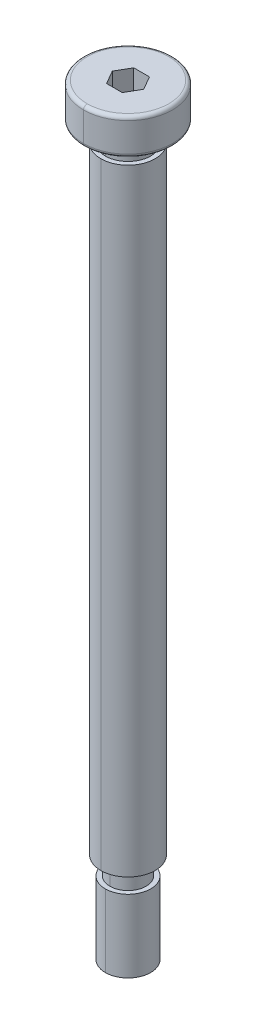
ISO-10303-21;
HEADER;
FILE_DESCRIPTION(('STEP AP214'),'2;1');
FILE_NAME('part.step','',(''),(''),'','','');
FILE_SCHEMA(('AUTOMOTIVE_DESIGN { 1 0 10303 214 1 1 1 1 }'));
ENDSEC;
DATA;
#1=APPLICATION_CONTEXT('core data for automotive mechanical design processes');
#2=APPLICATION_PROTOCOL_DEFINITION('international standard','automotive_design',2000,#1);
#3=PRODUCT_CONTEXT('',#1,'mechanical');
#4=PRODUCT('Part','Part','',(#3));
#5=PRODUCT_RELATED_PRODUCT_CATEGORY('part','',(#4));
#6=PRODUCT_DEFINITION_FORMATION('','',#4);
#7=PRODUCT_DEFINITION_CONTEXT('part definition',#1,'design');
#8=PRODUCT_DEFINITION('design','',#6,#7);
#9=PRODUCT_DEFINITION_SHAPE('','',#8);
#10=(LENGTH_UNIT() NAMED_UNIT(*) SI_UNIT(.MILLI.,.METRE.));
#11=(NAMED_UNIT(*) PLANE_ANGLE_UNIT() SI_UNIT($,.RADIAN.));
#12=(NAMED_UNIT(*) SI_UNIT($,.STERADIAN.) SOLID_ANGLE_UNIT());
#13=UNCERTAINTY_MEASURE_WITH_UNIT(LENGTH_MEASURE(1.E-05),#10,'distance_accuracy_value','');
#14=(GEOMETRIC_REPRESENTATION_CONTEXT(3) GLOBAL_UNCERTAINTY_ASSIGNED_CONTEXT((#13)) GLOBAL_UNIT_ASSIGNED_CONTEXT((#10,
#11,#12)) REPRESENTATION_CONTEXT('',''));
#15=CARTESIAN_POINT('',(0.,0.,0.));
#16=DIRECTION('',(0.,0.,1.));
#17=DIRECTION('',(1.,0.,0.));
#18=AXIS2_PLACEMENT_3D('',#15,#16,#17);
#19=CARTESIAN_POINT('',(0.,80.5,0.));
#20=DIRECTION('',(0.,1.,0.));
#21=DIRECTION('',(1.,0.,0.));
#22=AXIS2_PLACEMENT_3D('',#19,#20,#21);
#23=PLANE('',#22);
#24=DIRECTION('',(-0.5,0.,-0.866025403784439));
#25=VECTOR('',#24,1.);
#26=CARTESIAN_POINT('',(1.73205080756888,80.5,0.));
#27=LINE('',#26,#25);
#28=CARTESIAN_POINT('',(1.73205080756888,80.5,0.));
#29=VERTEX_POINT('',#28);
#30=CARTESIAN_POINT('',(0.866025403784438,80.5,-1.5));
#31=VERTEX_POINT('',#30);
#32=EDGE_CURVE('E191',#29,#31,#27,.T.);
#33=ORIENTED_EDGE('',*,*,#32,.T.);
#34=DIRECTION('',(-1.,0.,0.));
#35=VECTOR('',#34,1.);
#36=CARTESIAN_POINT('',(0.866025403784438,80.5,-1.5));
#37=LINE('',#36,#35);
#38=CARTESIAN_POINT('',(-0.866025403784439,80.5,-1.5));
#39=VERTEX_POINT('',#38);
#40=EDGE_CURVE('E10',#31,#39,#37,.T.);
#41=ORIENTED_EDGE('',*,*,#40,.T.);
#42=DIRECTION('',(-0.5,0.,0.866025403784439));
#43=VECTOR('',#42,1.);
#44=CARTESIAN_POINT('',(-0.866025403784439,80.5,-1.5));
#45=LINE('',#44,#43);
#46=CARTESIAN_POINT('',(-1.73205080756888,80.5,0.));
#47=VERTEX_POINT('',#46);
#48=EDGE_CURVE('E43',#39,#47,#45,.T.);
#49=ORIENTED_EDGE('',*,*,#48,.T.);
#50=DIRECTION('',(0.5,0.,0.866025403784439));
#51=VECTOR('',#50,1.);
#52=CARTESIAN_POINT('',(-1.73205080756888,80.5,0.));
#53=LINE('',#52,#51);
#54=CARTESIAN_POINT('',(-0.866025403784439,80.5,1.5));
#55=VERTEX_POINT('',#54);
#56=EDGE_CURVE('E269',#47,#55,#53,.T.);
#57=ORIENTED_EDGE('',*,*,#56,.T.);
#58=DIRECTION('',(1.,0.,0.));
#59=VECTOR('',#58,1.);
#60=CARTESIAN_POINT('',(-0.866025403784439,80.5,1.5));
#61=LINE('',#60,#59);
#62=CARTESIAN_POINT('',(0.866025403784438,80.5,1.5));
#63=VERTEX_POINT('',#62);
#64=EDGE_CURVE('E263',#55,#63,#61,.T.);
#65=ORIENTED_EDGE('',*,*,#64,.T.);
#66=DIRECTION('',(0.5,0.,-0.866025403784439));
#67=VECTOR('',#66,1.);
#68=CARTESIAN_POINT('',(0.866025403784438,80.5,1.5));
#69=LINE('',#68,#67);
#70=EDGE_CURVE('E257',#63,#29,#69,.T.);
#71=ORIENTED_EDGE('',*,*,#70,.T.);
#72=EDGE_LOOP('',(#33,#41,#49,#57,#65,#71));
#73=FACE_BOUND('',#72,.T.);
#74=ADVANCED_FACE('F16',(#73),#23,.T.);
#75=CARTESIAN_POINT('',(0.866025403784438,80.5,-1.5));
#76=DIRECTION('',(0.,0.,-1.));
#77=DIRECTION('',(-1.,0.,0.));
#78=AXIS2_PLACEMENT_3D('',#75,#76,#77);
#79=PLANE('',#78);
#80=DIRECTION('',(-1.,0.,0.));
#81=VECTOR('',#80,1.);
#82=CARTESIAN_POINT('',(0.866025403784438,84.,-1.5));
#83=LINE('',#82,#81);
#84=CARTESIAN_POINT('',(0.866025403784438,84.,-1.5));
#85=VERTEX_POINT('',#84);
#86=CARTESIAN_POINT('',(-0.866025403784439,84.,-1.5));
#87=VERTEX_POINT('',#86);
#88=EDGE_CURVE('E187',#85,#87,#83,.T.);
#89=ORIENTED_EDGE('',*,*,#88,.T.);
#90=DIRECTION('',(0.,1.,0.));
#91=VECTOR('',#90,1.);
#92=CARTESIAN_POINT('',(-0.866025403784439,80.5,-1.5));
#93=LINE('',#92,#91);
#94=EDGE_CURVE('E24',#39,#87,#93,.T.);
#95=ORIENTED_EDGE('',*,*,#94,.F.);
#96=ORIENTED_EDGE('',*,*,#40,.F.);
#97=DIRECTION('',(0.,1.,0.));
#98=VECTOR('',#97,1.);
#99=CARTESIAN_POINT('',(0.866025403784438,80.5,-1.5));
#100=LINE('',#99,#98);
#101=EDGE_CURVE('E183',#31,#85,#100,.T.);
#102=ORIENTED_EDGE('',*,*,#101,.T.);
#103=EDGE_LOOP('',(#89,#95,#96,#102));
#104=FACE_BOUND('',#103,.T.);
#105=ADVANCED_FACE('F185',(#104),#79,.F.);
#106=CARTESIAN_POINT('',(-0.866025403784439,80.5,-1.5));
#107=DIRECTION('',(-0.866025403784439,0.,-0.5));
#108=DIRECTION('',(-0.5,0.,0.866025403784439));
#109=AXIS2_PLACEMENT_3D('',#106,#107,#108);
#110=PLANE('',#109);
#111=DIRECTION('',(-0.5,0.,0.866025403784439));
#112=VECTOR('',#111,1.);
#113=CARTESIAN_POINT('',(-0.866025403784439,84.,-1.5));
#114=LINE('',#113,#112);
#115=CARTESIAN_POINT('',(-1.73205080756888,84.,0.));
#116=VERTEX_POINT('',#115);
#117=EDGE_CURVE('E210',#87,#116,#114,.T.);
#118=ORIENTED_EDGE('',*,*,#117,.T.);
#119=DIRECTION('',(0.,1.,0.));
#120=VECTOR('',#119,1.);
#121=CARTESIAN_POINT('',(-1.73205080756888,80.5,0.));
#122=LINE('',#121,#120);
#123=EDGE_CURVE('E272',#47,#116,#122,.T.);
#124=ORIENTED_EDGE('',*,*,#123,.F.);
#125=ORIENTED_EDGE('',*,*,#48,.F.);
#126=ORIENTED_EDGE('',*,*,#94,.T.);
#127=EDGE_LOOP('',(#118,#124,#125,#126));
#128=FACE_BOUND('',#127,.T.);
#129=ADVANCED_FACE('F280',(#128),#110,.F.);
#130=CARTESIAN_POINT('',(-1.73205080756888,80.5,0.));
#131=DIRECTION('',(-0.866025403784439,0.,0.5));
#132=DIRECTION('',(0.,1.,0.));
#133=AXIS2_PLACEMENT_3D('',#130,#131,#132);
#134=PLANE('',#133);
#135=DIRECTION('',(0.5,0.,0.866025403784439));
#136=VECTOR('',#135,1.);
#137=CARTESIAN_POINT('',(-1.73205080756888,84.,0.));
#138=LINE('',#137,#136);
#139=CARTESIAN_POINT('',(-0.866025403784439,84.,1.5));
#140=VERTEX_POINT('',#139);
#141=EDGE_CURVE('E227',#116,#140,#138,.T.);
#142=ORIENTED_EDGE('',*,*,#141,.T.);
#143=DIRECTION('',(0.,1.,0.));
#144=VECTOR('',#143,1.);
#145=CARTESIAN_POINT('',(-0.866025403784439,80.5,1.5));
#146=LINE('',#145,#144);
#147=EDGE_CURVE('E266',#55,#140,#146,.T.);
#148=ORIENTED_EDGE('',*,*,#147,.F.);
#149=ORIENTED_EDGE('',*,*,#56,.F.);
#150=ORIENTED_EDGE('',*,*,#123,.T.);
#151=EDGE_LOOP('',(#142,#148,#149,#150));
#152=FACE_BOUND('',#151,.T.);
#153=ADVANCED_FACE('F285',(#152),#134,.F.);
#154=CARTESIAN_POINT('',(-0.866025403784439,80.5,1.5));
#155=DIRECTION('',(0.,0.,1.));
#156=DIRECTION('',(1.,0.,0.));
#157=AXIS2_PLACEMENT_3D('',#154,#155,#156);
#158=PLANE('',#157);
#159=DIRECTION('',(1.,0.,0.));
#160=VECTOR('',#159,1.);
#161=CARTESIAN_POINT('',(-0.866025403784439,84.,1.5));
#162=LINE('',#161,#160);
#163=CARTESIAN_POINT('',(0.866025403784438,84.,1.5));
#164=VERTEX_POINT('',#163);
#165=EDGE_CURVE('E223',#140,#164,#162,.T.);
#166=ORIENTED_EDGE('',*,*,#165,.T.);
#167=DIRECTION('',(0.,1.,0.));
#168=VECTOR('',#167,1.);
#169=CARTESIAN_POINT('',(0.866025403784438,80.5,1.5));
#170=LINE('',#169,#168);
#171=EDGE_CURVE('E260',#63,#164,#170,.T.);
#172=ORIENTED_EDGE('',*,*,#171,.F.);
#173=ORIENTED_EDGE('',*,*,#64,.F.);
#174=ORIENTED_EDGE('',*,*,#147,.T.);
#175=EDGE_LOOP('',(#166,#172,#173,#174));
#176=FACE_BOUND('',#175,.T.);
#177=ADVANCED_FACE('F291',(#176),#158,.F.);
#178=CARTESIAN_POINT('',(0.866025403784438,80.5,1.5));
#179=DIRECTION('',(0.866025403784439,0.,0.5));
#180=DIRECTION('',(0.,-1.,0.));
#181=AXIS2_PLACEMENT_3D('',#178,#179,#180);
#182=PLANE('',#181);
#183=DIRECTION('',(0.5,0.,-0.866025403784439));
#184=VECTOR('',#183,1.);
#185=CARTESIAN_POINT('',(0.866025403784438,84.,1.5));
#186=LINE('',#185,#184);
#187=CARTESIAN_POINT('',(1.73205080756888,84.,0.));
#188=VERTEX_POINT('',#187);
#189=EDGE_CURVE('E203',#164,#188,#186,.T.);
#190=ORIENTED_EDGE('',*,*,#189,.T.);
#191=DIRECTION('',(0.,1.,0.));
#192=VECTOR('',#191,1.);
#193=CARTESIAN_POINT('',(1.73205080756888,80.5,0.));
#194=LINE('',#193,#192);
#195=EDGE_CURVE('E198',#29,#188,#194,.T.);
#196=ORIENTED_EDGE('',*,*,#195,.F.);
#197=ORIENTED_EDGE('',*,*,#70,.F.);
#198=ORIENTED_EDGE('',*,*,#171,.T.);
#199=EDGE_LOOP('',(#190,#196,#197,#198));
#200=FACE_BOUND('',#199,.T.);
#201=ADVANCED_FACE('F294',(#200),#182,.F.);
#202=CARTESIAN_POINT('',(1.73205080756888,80.5,0.));
#203=DIRECTION('',(0.866025403784439,0.,-0.5));
#204=DIRECTION('',(0.,-1.,0.));
#205=AXIS2_PLACEMENT_3D('',#202,#203,#204);
#206=PLANE('',#205);
#207=DIRECTION('',(-0.5,0.,-0.866025403784439));
#208=VECTOR('',#207,1.);
#209=CARTESIAN_POINT('',(1.73205080756888,84.,0.));
#210=LINE('',#209,#208);
#211=EDGE_CURVE('E195',#188,#85,#210,.T.);
#212=ORIENTED_EDGE('',*,*,#211,.T.);
#213=ORIENTED_EDGE('',*,*,#101,.F.);
#214=ORIENTED_EDGE('',*,*,#32,.F.);
#215=ORIENTED_EDGE('',*,*,#195,.T.);
#216=EDGE_LOOP('',(#212,#213,#214,#215));
#217=FACE_BOUND('',#216,.T.);
#218=ADVANCED_FACE('F196',(#217),#206,.F.);
#219=CARTESIAN_POINT('',(-2.5,0.,0.));
#220=DIRECTION('',(0.,1.,0.));
#221=DIRECTION('',(1.,0.,0.));
#222=AXIS2_PLACEMENT_3D('',#219,#220,#221);
#223=PLANE('',#222);
#224=CARTESIAN_POINT('',(0.,0.,0.));
#225=DIRECTION('',(0.,-1.,0.));
#226=DIRECTION('',(0.,0.,-1.));
#227=AXIS2_PLACEMENT_3D('',#224,#225,#226);
#228=CIRCLE('',#227,2.5);
#229=CARTESIAN_POINT('',(0.,0.,-2.5));
#230=VERTEX_POINT('',#229);
#231=CARTESIAN_POINT('',(0.,0.,2.5));
#232=VERTEX_POINT('',#231);
#233=EDGE_CURVE('E373',#230,#232,#228,.T.);
#234=ORIENTED_EDGE('',*,*,#233,.T.);
#235=CARTESIAN_POINT('',(0.,0.,0.));
#236=DIRECTION('',(0.,-1.,0.));
#237=DIRECTION('',(0.,0.,-1.));
#238=AXIS2_PLACEMENT_3D('',#235,#236,#237);
#239=CIRCLE('',#238,2.5);
#240=EDGE_CURVE('E192',#232,#230,#239,.T.);
#241=ORIENTED_EDGE('',*,*,#240,.T.);
#242=EDGE_LOOP('',(#234,#241));
#243=FACE_BOUND('',#242,.T.);
#244=ADVANCED_FACE('F452',(#243),#223,.F.);
#245=CARTESIAN_POINT('',(0.,0.,0.));
#246=DIRECTION('',(0.,-1.,0.));
#247=DIRECTION('',(0.,0.,-1.));
#248=AXIS2_PLACEMENT_3D('',#245,#246,#247);
#249=CYLINDRICAL_SURFACE('',#248,2.5);
#250=DIRECTION('',(0.,-1.,0.));
#251=VECTOR('',#250,1.);
#252=CARTESIAN_POINT('',(0.,0.,2.5));
#253=LINE('',#252,#251);
#254=CARTESIAN_POINT('',(0.,8.,2.5));
#255=VERTEX_POINT('',#254);
#256=EDGE_CURVE('E382',#255,#232,#253,.T.);
#257=ORIENTED_EDGE('',*,*,#256,.F.);
#258=CARTESIAN_POINT('',(0.,8.,0.));
#259=DIRECTION('',(0.,-1.,0.));
#260=DIRECTION('',(0.,0.,-1.));
#261=AXIS2_PLACEMENT_3D('',#258,#259,#260);
#262=CIRCLE('',#261,2.5);
#263=CARTESIAN_POINT('',(0.,8.,-2.5));
#264=VERTEX_POINT('',#263);
#265=EDGE_CURVE('E250',#255,#264,#262,.T.);
#266=ORIENTED_EDGE('',*,*,#265,.T.);
#267=DIRECTION('',(0.,-1.,0.));
#268=VECTOR('',#267,1.);
#269=CARTESIAN_POINT('',(0.,0.,-2.5));
#270=LINE('',#269,#268);
#271=EDGE_CURVE('E369',#264,#230,#270,.T.);
#272=ORIENTED_EDGE('',*,*,#271,.T.);
#273=ORIENTED_EDGE('',*,*,#240,.F.);
#274=EDGE_LOOP('',(#257,#266,#272,#273));
#275=FACE_BOUND('',#274,.T.);
#276=ADVANCED_FACE('F455',(#275),#249,.T.);
#277=CARTESIAN_POINT('',(-2.,8.,0.));
#278=DIRECTION('',(0.,-1.,0.));
#279=DIRECTION('',(0.,0.,-1.));
#280=AXIS2_PLACEMENT_3D('',#277,#278,#279);
#281=PLANE('',#280);
#282=CARTESIAN_POINT('',(0.,8.,0.));
#283=DIRECTION('',(0.,-1.,0.));
#284=DIRECTION('',(0.,0.,-1.));
#285=AXIS2_PLACEMENT_3D('',#282,#283,#284);
#286=CIRCLE('',#285,2.);
#287=CARTESIAN_POINT('',(0.,8.,-2.));
#288=VERTEX_POINT('',#287);
#289=CARTESIAN_POINT('',(0.,8.,2.));
#290=VERTEX_POINT('',#289);
#291=EDGE_CURVE('E360',#288,#290,#286,.T.);
#292=ORIENTED_EDGE('',*,*,#291,.T.);
#293=CARTESIAN_POINT('',(0.,8.,0.));
#294=DIRECTION('',(0.,-1.,0.));
#295=DIRECTION('',(0.,0.,-1.));
#296=AXIS2_PLACEMENT_3D('',#293,#294,#295);
#297=CIRCLE('',#296,2.);
#298=EDGE_CURVE('E247',#290,#288,#297,.T.);
#299=ORIENTED_EDGE('',*,*,#298,.T.);
#300=EDGE_LOOP('',(#292,#299));
#301=FACE_BOUND('',#300,.T.);
#302=CARTESIAN_POINT('',(0.,8.,0.));
#303=DIRECTION('',(0.,-1.,0.));
#304=DIRECTION('',(0.,0.,-1.));
#305=AXIS2_PLACEMENT_3D('',#302,#303,#304);
#306=CIRCLE('',#305,2.5);
#307=EDGE_CURVE('E397',#264,#255,#306,.T.);
#308=ORIENTED_EDGE('',*,*,#307,.F.);
#309=ORIENTED_EDGE('',*,*,#265,.F.);
#310=EDGE_LOOP('',(#308,#309));
#311=FACE_BOUND('',#310,.T.);
#312=ADVANCED_FACE('F432',(#301,#311),#281,.F.);
#313=CARTESIAN_POINT('',(0.,0.,0.));
#314=DIRECTION('',(0.,-1.,0.));
#315=DIRECTION('',(0.,0.,-1.));
#316=AXIS2_PLACEMENT_3D('',#313,#314,#315);
#317=CYLINDRICAL_SURFACE('',#316,2.);
#318=DIRECTION('',(0.,-1.,0.));
#319=VECTOR('',#318,1.);
#320=CARTESIAN_POINT('',(0.,0.,2.));
#321=LINE('',#320,#319);
#322=CARTESIAN_POINT('',(0.,10.,2.));
#323=VERTEX_POINT('',#322);
#324=EDGE_CURVE('E364',#323,#290,#321,.T.);
#325=ORIENTED_EDGE('',*,*,#324,.F.);
#326=CARTESIAN_POINT('',(0.,10.,0.));
#327=DIRECTION('',(0.,-1.,0.));
#328=DIRECTION('',(0.,0.,-1.));
#329=AXIS2_PLACEMENT_3D('',#326,#327,#328);
#330=CIRCLE('',#329,2.);
#331=CARTESIAN_POINT('',(0.,10.,-2.));
#332=VERTEX_POINT('',#331);
#333=EDGE_CURVE('E246',#323,#332,#330,.T.);
#334=ORIENTED_EDGE('',*,*,#333,.T.);
#335=DIRECTION('',(0.,-1.,0.));
#336=VECTOR('',#335,1.);
#337=CARTESIAN_POINT('',(0.,0.,-2.));
#338=LINE('',#337,#336);
#339=EDGE_CURVE('E359',#332,#288,#338,.T.);
#340=ORIENTED_EDGE('',*,*,#339,.T.);
#341=ORIENTED_EDGE('',*,*,#298,.F.);
#342=EDGE_LOOP('',(#325,#334,#340,#341));
#343=FACE_BOUND('',#342,.T.);
#344=ADVANCED_FACE('F422',(#343),#317,.T.);
#345=CARTESIAN_POINT('',(-3.,10.,0.));
#346=DIRECTION('',(0.,1.,0.));
#347=DIRECTION('',(1.,0.,0.));
#348=AXIS2_PLACEMENT_3D('',#345,#346,#347);
#349=PLANE('',#348);
#350=CARTESIAN_POINT('',(0.,10.,0.));
#351=DIRECTION('',(0.,-1.,0.));
#352=DIRECTION('',(0.,0.,-1.));
#353=AXIS2_PLACEMENT_3D('',#350,#351,#352);
#354=CIRCLE('',#353,2.);
#355=EDGE_CURVE('E365',#332,#323,#354,.T.);
#356=ORIENTED_EDGE('',*,*,#355,.F.);
#357=ORIENTED_EDGE('',*,*,#333,.F.);
#358=EDGE_LOOP('',(#356,#357));
#359=FACE_BOUND('',#358,.T.);
#360=CARTESIAN_POINT('',(0.,10.,0.));
#361=DIRECTION('',(0.,-1.,0.));
#362=DIRECTION('',(0.,0.,-1.));
#363=AXIS2_PLACEMENT_3D('',#360,#361,#362);
#364=CIRCLE('',#363,3.);
#365=CARTESIAN_POINT('',(0.,10.,-3.));
#366=VERTEX_POINT('',#365);
#367=CARTESIAN_POINT('',(0.,10.,3.));
#368=VERTEX_POINT('',#367);
#369=EDGE_CURVE('E349',#366,#368,#364,.T.);
#370=ORIENTED_EDGE('',*,*,#369,.T.);
#371=CARTESIAN_POINT('',(0.,10.,0.));
#372=DIRECTION('',(0.,-1.,0.));
#373=DIRECTION('',(0.,0.,-1.));
#374=AXIS2_PLACEMENT_3D('',#371,#372,#373);
#375=CIRCLE('',#374,3.);
#376=EDGE_CURVE('E243',#368,#366,#375,.T.);
#377=ORIENTED_EDGE('',*,*,#376,.T.);
#378=EDGE_LOOP('',(#370,#377));
#379=FACE_BOUND('',#378,.T.);
#380=ADVANCED_FACE('F420',(#359,#379),#349,.F.);
#381=CARTESIAN_POINT('',(0.,0.,0.));
#382=DIRECTION('',(0.,-1.,0.));
#383=DIRECTION('',(0.,0.,-1.));
#384=AXIS2_PLACEMENT_3D('',#381,#382,#383);
#385=CYLINDRICAL_SURFACE('',#384,3.);
#386=DIRECTION('',(0.,-1.,0.));
#387=VECTOR('',#386,1.);
#388=CARTESIAN_POINT('',(0.,0.,3.));
#389=LINE('',#388,#387);
#390=CARTESIAN_POINT('',(0.,78.,3.));
#391=VERTEX_POINT('',#390);
#392=EDGE_CURVE('E354',#391,#368,#389,.T.);
#393=ORIENTED_EDGE('',*,*,#392,.F.);
#394=CARTESIAN_POINT('',(0.,78.,0.));
#395=DIRECTION('',(0.,-1.,0.));
#396=DIRECTION('',(0.,0.,-1.));
#397=AXIS2_PLACEMENT_3D('',#394,#395,#396);
#398=CIRCLE('',#397,3.);
#399=CARTESIAN_POINT('',(0.,78.,-3.));
#400=VERTEX_POINT('',#399);
#401=EDGE_CURVE('E242',#391,#400,#398,.T.);
#402=ORIENTED_EDGE('',*,*,#401,.T.);
#403=DIRECTION('',(0.,-1.,0.));
#404=VECTOR('',#403,1.);
#405=CARTESIAN_POINT('',(0.,0.,-3.));
#406=LINE('',#405,#404);
#407=EDGE_CURVE('E353',#400,#366,#406,.T.);
#408=ORIENTED_EDGE('',*,*,#407,.T.);
#409=ORIENTED_EDGE('',*,*,#376,.F.);
#410=EDGE_LOOP('',(#393,#402,#408,#409));
#411=FACE_BOUND('',#410,.T.);
#412=ADVANCED_FACE('F415',(#411),#385,.T.);
#413=CARTESIAN_POINT('',(-2.5,78.,0.));
#414=DIRECTION('',(0.,-1.,0.));
#415=DIRECTION('',(0.,0.,-1.));
#416=AXIS2_PLACEMENT_3D('',#413,#414,#415);
#417=PLANE('',#416);
#418=CARTESIAN_POINT('',(0.,78.,0.));
#419=DIRECTION('',(0.,-1.,0.));
#420=DIRECTION('',(0.,0.,-1.));
#421=AXIS2_PLACEMENT_3D('',#418,#419,#420);
#422=CIRCLE('',#421,2.5);
#423=CARTESIAN_POINT('',(0.,78.,-2.5));
#424=VERTEX_POINT('',#423);
#425=CARTESIAN_POINT('',(0.,78.,2.5));
#426=VERTEX_POINT('',#425);
#427=EDGE_CURVE('E343',#424,#426,#422,.T.);
#428=ORIENTED_EDGE('',*,*,#427,.T.);
#429=CARTESIAN_POINT('',(0.,78.,0.));
#430=DIRECTION('',(0.,-1.,0.));
#431=DIRECTION('',(0.,0.,-1.));
#432=AXIS2_PLACEMENT_3D('',#429,#430,#431);
#433=CIRCLE('',#432,2.5);
#434=EDGE_CURVE('E239',#426,#424,#433,.T.);
#435=ORIENTED_EDGE('',*,*,#434,.T.);
#436=EDGE_LOOP('',(#428,#435));
#437=FACE_BOUND('',#436,.T.);
#438=CARTESIAN_POINT('',(0.,78.,0.));
#439=DIRECTION('',(0.,-1.,0.));
#440=DIRECTION('',(0.,0.,-1.));
#441=AXIS2_PLACEMENT_3D('',#438,#439,#440);
#442=CIRCLE('',#441,3.);
#443=EDGE_CURVE('E355',#400,#391,#442,.T.);
#444=ORIENTED_EDGE('',*,*,#443,.F.);
#445=ORIENTED_EDGE('',*,*,#401,.F.);
#446=EDGE_LOOP('',(#444,#445));
#447=FACE_BOUND('',#446,.T.);
#448=ADVANCED_FACE('F430',(#437,#447),#417,.F.);
#449=CARTESIAN_POINT('',(0.,0.,0.));
#450=DIRECTION('',(0.,-1.,0.));
#451=DIRECTION('',(0.,0.,-1.));
#452=AXIS2_PLACEMENT_3D('',#449,#450,#451);
#453=CYLINDRICAL_SURFACE('',#452,2.5);
#454=DIRECTION('',(0.,-1.,0.));
#455=VECTOR('',#454,1.);
#456=CARTESIAN_POINT('',(0.,0.,2.5));
#457=LINE('',#456,#455);
#458=CARTESIAN_POINT('',(0.,80.,2.5));
#459=VERTEX_POINT('',#458);
#460=EDGE_CURVE('E344',#459,#426,#457,.T.);
#461=ORIENTED_EDGE('',*,*,#460,.F.);
#462=CARTESIAN_POINT('',(0.,80.,0.));
#463=DIRECTION('',(0.,-1.,0.));
#464=DIRECTION('',(0.,0.,-1.));
#465=AXIS2_PLACEMENT_3D('',#462,#463,#464);
#466=CIRCLE('',#465,2.5);
#467=CARTESIAN_POINT('',(0.,80.,-2.5));
#468=VERTEX_POINT('',#467);
#469=EDGE_CURVE('E236',#459,#468,#466,.T.);
#470=ORIENTED_EDGE('',*,*,#469,.T.);
#471=DIRECTION('',(0.,-1.,0.));
#472=VECTOR('',#471,1.);
#473=CARTESIAN_POINT('',(0.,0.,-2.5));
#474=LINE('',#473,#472);
#475=EDGE_CURVE('E339',#468,#424,#474,.T.);
#476=ORIENTED_EDGE('',*,*,#475,.T.);
#477=ORIENTED_EDGE('',*,*,#434,.F.);
#478=EDGE_LOOP('',(#461,#470,#476,#477));
#479=FACE_BOUND('',#478,.T.);
#480=ADVANCED_FACE('F467',(#479),#453,.T.);
#481=CARTESIAN_POINT('',(-4.5,80.,0.));
#482=DIRECTION('',(0.,1.,0.));
#483=DIRECTION('',(1.,0.,0.));
#484=AXIS2_PLACEMENT_3D('',#481,#482,#483);
#485=PLANE('',#484);
#486=CARTESIAN_POINT('',(0.,80.,0.));
#487=DIRECTION('',(0.,-1.,0.));
#488=DIRECTION('',(0.,0.,-1.));
#489=AXIS2_PLACEMENT_3D('',#486,#487,#488);
#490=CIRCLE('',#489,2.5);
#491=EDGE_CURVE('E348',#468,#459,#490,.T.);
#492=ORIENTED_EDGE('',*,*,#491,.F.);
#493=ORIENTED_EDGE('',*,*,#469,.F.);
#494=EDGE_LOOP('',(#492,#493));
#495=FACE_BOUND('',#494,.T.);
#496=CARTESIAN_POINT('',(0.,80.,0.));
#497=DIRECTION('',(0.,-1.,0.));
#498=DIRECTION('',(0.,0.,-1.));
#499=AXIS2_PLACEMENT_3D('',#496,#497,#498);
#500=CIRCLE('',#499,4.5);
#501=CARTESIAN_POINT('',(0.,80.,-4.5));
#502=VERTEX_POINT('',#501);
#503=CARTESIAN_POINT('',(0.,80.,4.5));
#504=VERTEX_POINT('',#503);
#505=EDGE_CURVE('E325',#502,#504,#500,.T.);
#506=ORIENTED_EDGE('',*,*,#505,.T.);
#507=CARTESIAN_POINT('',(0.,80.,0.));
#508=DIRECTION('',(0.,-1.,0.));
#509=DIRECTION('',(0.,0.,-1.));
#510=AXIS2_PLACEMENT_3D('',#507,#508,#509);
#511=CIRCLE('',#510,4.5);
#512=EDGE_CURVE('E233',#504,#502,#511,.T.);
#513=ORIENTED_EDGE('',*,*,#512,.T.);
#514=EDGE_LOOP('',(#506,#513));
#515=FACE_BOUND('',#514,.T.);
#516=ADVANCED_FACE('F463',(#495,#515),#485,.F.);
#517=CARTESIAN_POINT('',(0.,80.4,0.));
#518=DIRECTION('',(0.,-1.,0.));
#519=DIRECTION('',(0.,0.,-1.));
#520=AXIS2_PLACEMENT_3D('',#517,#518,#519);
#521=TOROIDAL_SURFACE('',#520,4.5,0.399999999999992);
#522=CARTESIAN_POINT('',(0.,80.4,4.5));
#523=DIRECTION('',(1.,0.,0.));
#524=DIRECTION('',(0.,0.,-1.));
#525=AXIS2_PLACEMENT_3D('',#522,#523,#524);
#526=CIRCLE('',#525,0.399999999999992);
#527=CARTESIAN_POINT('',(0.,80.4,4.9));
#528=VERTEX_POINT('',#527);
#529=EDGE_CURVE('E334',#528,#504,#526,.T.);
#530=ORIENTED_EDGE('',*,*,#529,.F.);
#531=CARTESIAN_POINT('',(0.,80.4,0.));
#532=DIRECTION('',(0.,-1.,0.));
#533=DIRECTION('',(0.,0.,-1.));
#534=AXIS2_PLACEMENT_3D('',#531,#532,#533);
#535=CIRCLE('',#534,4.9);
#536=CARTESIAN_POINT('',(0.,80.4,-4.9));
#537=VERTEX_POINT('',#536);
#538=EDGE_CURVE('E230',#528,#537,#535,.T.);
#539=ORIENTED_EDGE('',*,*,#538,.T.);
#540=CARTESIAN_POINT('',(0.,80.4,-4.5));
#541=DIRECTION('',(-1.,0.,0.));
#542=DIRECTION('',(0.,0.,1.));
#543=AXIS2_PLACEMENT_3D('',#540,#541,#542);
#544=CIRCLE('',#543,0.399999999999992);
#545=EDGE_CURVE('E321',#537,#502,#544,.T.);
#546=ORIENTED_EDGE('',*,*,#545,.T.);
#547=ORIENTED_EDGE('',*,*,#512,.F.);
#548=EDGE_LOOP('',(#530,#539,#546,#547));
#549=FACE_BOUND('',#548,.T.);
#550=ADVANCED_FACE('F466',(#549),#521,.T.);
#551=CARTESIAN_POINT('',(0.,0.,0.));
#552=DIRECTION('',(0.,-1.,0.));
#553=DIRECTION('',(0.,0.,-1.));
#554=AXIS2_PLACEMENT_3D('',#551,#552,#553);
#555=CYLINDRICAL_SURFACE('',#554,4.9);
#556=DIRECTION('',(0.,-1.,0.));
#557=VECTOR('',#556,1.);
#558=CARTESIAN_POINT('',(0.,0.,4.9));
#559=LINE('',#558,#557);
#560=CARTESIAN_POINT('',(0.,83.6,4.9));
#561=VERTEX_POINT('',#560);
#562=EDGE_CURVE('E315',#561,#528,#559,.T.);
#563=ORIENTED_EDGE('',*,*,#562,.F.);
#564=CARTESIAN_POINT('',(0.,83.6,0.));
#565=DIRECTION('',(0.,-1.,0.));
#566=DIRECTION('',(0.,0.,-1.));
#567=AXIS2_PLACEMENT_3D('',#564,#565,#566);
#568=CIRCLE('',#567,4.9);
#569=CARTESIAN_POINT('',(0.,83.6,-4.9));
#570=VERTEX_POINT('',#569);
#571=EDGE_CURVE('E226',#561,#570,#568,.T.);
#572=ORIENTED_EDGE('',*,*,#571,.T.);
#573=DIRECTION('',(0.,-1.,0.));
#574=VECTOR('',#573,1.);
#575=CARTESIAN_POINT('',(0.,0.,-4.9));
#576=LINE('',#575,#574);
#577=EDGE_CURVE('E312',#570,#537,#576,.T.);
#578=ORIENTED_EDGE('',*,*,#577,.T.);
#579=ORIENTED_EDGE('',*,*,#538,.F.);
#580=EDGE_LOOP('',(#563,#572,#578,#579));
#581=FACE_BOUND('',#580,.T.);
#582=ADVANCED_FACE('F469',(#581),#555,.T.);
#583=CARTESIAN_POINT('',(0.,83.6,0.));
#584=DIRECTION('',(0.,-1.,0.));
#585=DIRECTION('',(0.,0.,-1.));
#586=AXIS2_PLACEMENT_3D('',#583,#584,#585);
#587=TOROIDAL_SURFACE('',#586,4.5,0.399999999999985);
#588=CARTESIAN_POINT('',(0.,83.6,4.5));
#589=DIRECTION('',(1.,0.,0.));
#590=DIRECTION('',(0.,0.,-1.));
#591=AXIS2_PLACEMENT_3D('',#588,#589,#590);
#592=CIRCLE('',#591,0.399999999999985);
#593=CARTESIAN_POINT('',(0.,84.,4.5));
#594=VERTEX_POINT('',#593);
#595=EDGE_CURVE('E304',#594,#561,#592,.T.);
#596=ORIENTED_EDGE('',*,*,#595,.F.);
#597=CARTESIAN_POINT('',(0.,84.,0.));
#598=DIRECTION('',(0.,-1.,0.));
#599=DIRECTION('',(0.,0.,-1.));
#600=AXIS2_PLACEMENT_3D('',#597,#598,#599);
#601=CIRCLE('',#600,4.5);
#602=CARTESIAN_POINT('',(0.,84.,-4.5));
#603=VERTEX_POINT('',#602);
#604=EDGE_CURVE('E212',#594,#603,#601,.T.);
#605=ORIENTED_EDGE('',*,*,#604,.T.);
#606=CARTESIAN_POINT('',(0.,83.6,-4.5));
#607=DIRECTION('',(-1.,0.,0.));
#608=DIRECTION('',(0.,0.,1.));
#609=AXIS2_PLACEMENT_3D('',#606,#607,#608);
#610=CIRCLE('',#609,0.399999999999985);
#611=EDGE_CURVE('E217',#603,#570,#610,.T.);
#612=ORIENTED_EDGE('',*,*,#611,.T.);
#613=ORIENTED_EDGE('',*,*,#571,.F.);
#614=EDGE_LOOP('',(#596,#605,#612,#613));
#615=FACE_BOUND('',#614,.T.);
#616=ADVANCED_FACE('F472',(#615),#587,.T.);
#617=CARTESIAN_POINT('',(0.,84.,0.));
#618=DIRECTION('',(0.,-1.,0.));
#619=DIRECTION('',(0.,0.,-1.));
#620=AXIS2_PLACEMENT_3D('',#617,#618,#619);
#621=PLANE('',#620);
#622=ORIENTED_EDGE('',*,*,#88,.F.);
#623=ORIENTED_EDGE('',*,*,#211,.F.);
#624=ORIENTED_EDGE('',*,*,#189,.F.);
#625=ORIENTED_EDGE('',*,*,#165,.F.);
#626=ORIENTED_EDGE('',*,*,#141,.F.);
#627=ORIENTED_EDGE('',*,*,#117,.F.);
#628=EDGE_LOOP('',(#622,#623,#624,#625,#626,#627));
#629=FACE_BOUND('',#628,.T.);
#630=CARTESIAN_POINT('',(0.,84.,0.));
#631=DIRECTION('',(0.,-1.,0.));
#632=DIRECTION('',(0.,0.,-1.));
#633=AXIS2_PLACEMENT_3D('',#630,#631,#632);
#634=CIRCLE('',#633,4.5);
#635=EDGE_CURVE('E308',#603,#594,#634,.T.);
#636=ORIENTED_EDGE('',*,*,#635,.F.);
#637=ORIENTED_EDGE('',*,*,#604,.F.);
#638=EDGE_LOOP('',(#636,#637));
#639=FACE_BOUND('',#638,.T.);
#640=ADVANCED_FACE('F206',(#629,#639),#621,.F.);
#641=CARTESIAN_POINT('',(0.,83.6,0.));
#642=DIRECTION('',(0.,-1.,0.));
#643=DIRECTION('',(0.,0.,-1.));
#644=AXIS2_PLACEMENT_3D('',#641,#642,#643);
#645=TOROIDAL_SURFACE('',#644,4.5,0.399999999999985);
#646=ORIENTED_EDGE('',*,*,#635,.T.);
#647=ORIENTED_EDGE('',*,*,#595,.T.);
#648=CARTESIAN_POINT('',(0.,83.6,0.));
#649=DIRECTION('',(0.,-1.,0.));
#650=DIRECTION('',(0.,0.,-1.));
#651=AXIS2_PLACEMENT_3D('',#648,#649,#650);
#652=CIRCLE('',#651,4.9);
#653=EDGE_CURVE('E320',#570,#561,#652,.T.);
#654=ORIENTED_EDGE('',*,*,#653,.F.);
#655=ORIENTED_EDGE('',*,*,#611,.F.);
#656=EDGE_LOOP('',(#646,#647,#654,#655));
#657=FACE_BOUND('',#656,.T.);
#658=ADVANCED_FACE('F481',(#657),#645,.T.);
#659=CARTESIAN_POINT('',(0.,0.,0.));
#660=DIRECTION('',(0.,-1.,0.));
#661=DIRECTION('',(0.,0.,-1.));
#662=AXIS2_PLACEMENT_3D('',#659,#660,#661);
#663=CYLINDRICAL_SURFACE('',#662,4.9);
#664=ORIENTED_EDGE('',*,*,#653,.T.);
#665=ORIENTED_EDGE('',*,*,#562,.T.);
#666=CARTESIAN_POINT('',(0.,80.4,0.));
#667=DIRECTION('',(0.,-1.,0.));
#668=DIRECTION('',(0.,0.,-1.));
#669=AXIS2_PLACEMENT_3D('',#666,#667,#668);
#670=CIRCLE('',#669,4.9);
#671=EDGE_CURVE('E335',#537,#528,#670,.T.);
#672=ORIENTED_EDGE('',*,*,#671,.F.);
#673=ORIENTED_EDGE('',*,*,#577,.F.);
#674=EDGE_LOOP('',(#664,#665,#672,#673));
#675=FACE_BOUND('',#674,.T.);
#676=ADVANCED_FACE('F484',(#675),#663,.T.);
#677=CARTESIAN_POINT('',(0.,80.4,0.));
#678=DIRECTION('',(0.,-1.,0.));
#679=DIRECTION('',(0.,0.,-1.));
#680=AXIS2_PLACEMENT_3D('',#677,#678,#679);
#681=TOROIDAL_SURFACE('',#680,4.5,0.399999999999992);
#682=ORIENTED_EDGE('',*,*,#671,.T.);
#683=ORIENTED_EDGE('',*,*,#529,.T.);
#684=ORIENTED_EDGE('',*,*,#505,.F.);
#685=ORIENTED_EDGE('',*,*,#545,.F.);
#686=EDGE_LOOP('',(#682,#683,#684,#685));
#687=FACE_BOUND('',#686,.T.);
#688=ADVANCED_FACE('F494',(#687),#681,.T.);
#689=CARTESIAN_POINT('',(0.,0.,0.));
#690=DIRECTION('',(0.,-1.,0.));
#691=DIRECTION('',(0.,0.,-1.));
#692=AXIS2_PLACEMENT_3D('',#689,#690,#691);
#693=CYLINDRICAL_SURFACE('',#692,2.5);
#694=ORIENTED_EDGE('',*,*,#491,.T.);
#695=ORIENTED_EDGE('',*,*,#460,.T.);
#696=ORIENTED_EDGE('',*,*,#427,.F.);
#697=ORIENTED_EDGE('',*,*,#475,.F.);
#698=EDGE_LOOP('',(#694,#695,#696,#697));
#699=FACE_BOUND('',#698,.T.);
#700=ADVANCED_FACE('F498',(#699),#693,.T.);
#701=CARTESIAN_POINT('',(0.,0.,0.));
#702=DIRECTION('',(0.,-1.,0.));
#703=DIRECTION('',(0.,0.,-1.));
#704=AXIS2_PLACEMENT_3D('',#701,#702,#703);
#705=CYLINDRICAL_SURFACE('',#704,3.);
#706=ORIENTED_EDGE('',*,*,#443,.T.);
#707=ORIENTED_EDGE('',*,*,#392,.T.);
#708=ORIENTED_EDGE('',*,*,#369,.F.);
#709=ORIENTED_EDGE('',*,*,#407,.F.);
#710=EDGE_LOOP('',(#706,#707,#708,#709));
#711=FACE_BOUND('',#710,.T.);
#712=ADVANCED_FACE('F418',(#711),#705,.T.);
#713=CARTESIAN_POINT('',(0.,0.,0.));
#714=DIRECTION('',(0.,-1.,0.));
#715=DIRECTION('',(0.,0.,-1.));
#716=AXIS2_PLACEMENT_3D('',#713,#714,#715);
#717=CYLINDRICAL_SURFACE('',#716,2.);
#718=ORIENTED_EDGE('',*,*,#355,.T.);
#719=ORIENTED_EDGE('',*,*,#324,.T.);
#720=ORIENTED_EDGE('',*,*,#291,.F.);
#721=ORIENTED_EDGE('',*,*,#339,.F.);
#722=EDGE_LOOP('',(#718,#719,#720,#721));
#723=FACE_BOUND('',#722,.T.);
#724=ADVANCED_FACE('F505',(#723),#717,.T.);
#725=CARTESIAN_POINT('',(0.,0.,0.));
#726=DIRECTION('',(0.,-1.,0.));
#727=DIRECTION('',(0.,0.,-1.));
#728=AXIS2_PLACEMENT_3D('',#725,#726,#727);
#729=CYLINDRICAL_SURFACE('',#728,2.5);
#730=ORIENTED_EDGE('',*,*,#307,.T.);
#731=ORIENTED_EDGE('',*,*,#256,.T.);
#732=ORIENTED_EDGE('',*,*,#233,.F.);
#733=ORIENTED_EDGE('',*,*,#271,.F.);
#734=EDGE_LOOP('',(#730,#731,#732,#733));
#735=FACE_BOUND('',#734,.T.);
#736=ADVANCED_FACE('F508',(#735),#729,.T.);
#737=CLOSED_SHELL('',(#74,#105,#129,#153,#177,#201,#218,#244,#276,#312,#344,#380,#412,#448,#480,
#516,#550,#582,#616,#640,#658,#676,#688,#700,#712,#724,#736));
#738=MANIFOLD_SOLID_BREP('B1',#737);
#739=ADVANCED_BREP_SHAPE_REPRESENTATION('',(#18,#738),#14);
#740=SHAPE_DEFINITION_REPRESENTATION(#9,#739);
ENDSEC;
END-ISO-10303-21;
